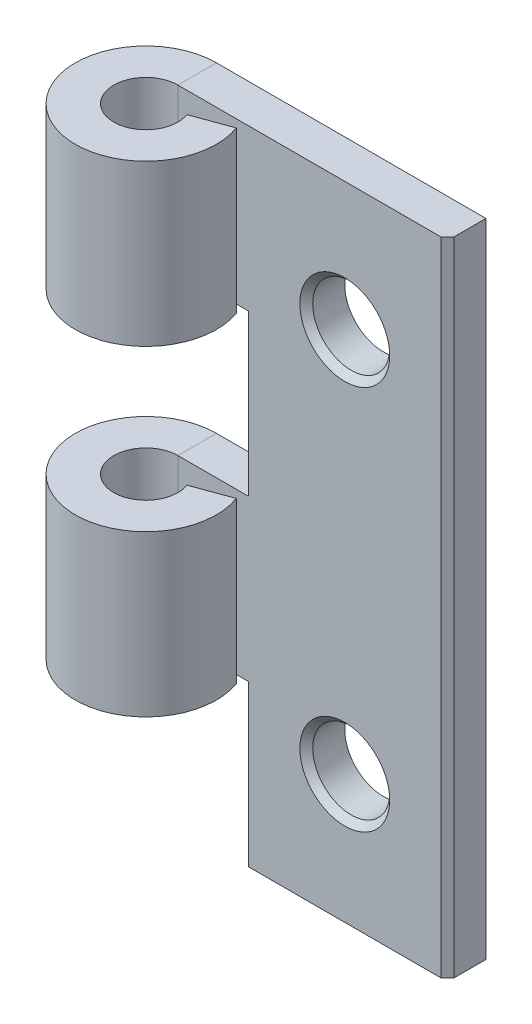
ISO-10303-21;
HEADER;
FILE_DESCRIPTION(('STEP AP214'),'2;1');
FILE_NAME('part.step','',(''),(''),'','','');
FILE_SCHEMA(('AUTOMOTIVE_DESIGN { 1 0 10303 214 1 1 1 1 }'));
ENDSEC;
DATA;
#1=APPLICATION_CONTEXT('core data for automotive mechanical design processes');
#2=APPLICATION_PROTOCOL_DEFINITION('international standard','automotive_design',2000,#1);
#3=PRODUCT_CONTEXT('',#1,'mechanical');
#4=PRODUCT('Part','Part','',(#3));
#5=PRODUCT_RELATED_PRODUCT_CATEGORY('part','',(#4));
#6=PRODUCT_DEFINITION_FORMATION('','',#4);
#7=PRODUCT_DEFINITION_CONTEXT('part definition',#1,'design');
#8=PRODUCT_DEFINITION('design','',#6,#7);
#9=PRODUCT_DEFINITION_SHAPE('','',#8);
#10=(LENGTH_UNIT() NAMED_UNIT(*) SI_UNIT(.MILLI.,.METRE.));
#11=(NAMED_UNIT(*) PLANE_ANGLE_UNIT() SI_UNIT($,.RADIAN.));
#12=(NAMED_UNIT(*) SI_UNIT($,.STERADIAN.) SOLID_ANGLE_UNIT());
#13=UNCERTAINTY_MEASURE_WITH_UNIT(LENGTH_MEASURE(1.E-05),#10,'distance_accuracy_value','');
#14=(GEOMETRIC_REPRESENTATION_CONTEXT(3) GLOBAL_UNCERTAINTY_ASSIGNED_CONTEXT((#13)) GLOBAL_UNIT_ASSIGNED_CONTEXT((#10,
#11,#12)) REPRESENTATION_CONTEXT('',''));
#15=CARTESIAN_POINT('',(0.,0.,0.));
#16=DIRECTION('',(0.,0.,1.));
#17=DIRECTION('',(1.,0.,0.));
#18=AXIS2_PLACEMENT_3D('',#15,#16,#17);
#19=CARTESIAN_POINT('',(10.5,-25.,3.));
#20=DIRECTION('',(-1.,0.,0.));
#21=DIRECTION('',(0.,0.,1.));
#22=AXIS2_PLACEMENT_3D('',#19,#20,#21);
#23=PLANE('',#22);
#24=DIRECTION('',(0.,0.,-1.));
#25=VECTOR('',#24,1.);
#26=CARTESIAN_POINT('',(10.5,25.,3.));
#27=LINE('',#26,#25);
#28=CARTESIAN_POINT('',(10.5,25.,2.49999999999999));
#29=VERTEX_POINT('',#28);
#30=CARTESIAN_POINT('',(10.5,25.,0.));
#31=VERTEX_POINT('',#30);
#32=EDGE_CURVE('E276',#29,#31,#27,.T.);
#33=ORIENTED_EDGE('',*,*,#32,.F.);
#34=DIRECTION('',(0.,-1.,0.));
#35=VECTOR('',#34,1.);
#36=CARTESIAN_POINT('',(10.5,-25.,2.49999999999999));
#37=LINE('',#36,#35);
#38=CARTESIAN_POINT('',(10.5,-25.,2.49999999999999));
#39=VERTEX_POINT('',#38);
#40=EDGE_CURVE('E54',#29,#39,#37,.T.);
#41=ORIENTED_EDGE('',*,*,#40,.T.);
#42=DIRECTION('',(0.,0.,-1.));
#43=VECTOR('',#42,1.);
#44=CARTESIAN_POINT('',(10.5,-25.,3.));
#45=LINE('',#44,#43);
#46=CARTESIAN_POINT('',(10.5,-25.,0.));
#47=VERTEX_POINT('',#46);
#48=EDGE_CURVE('E262',#39,#47,#45,.T.);
#49=ORIENTED_EDGE('',*,*,#48,.T.);
#50=DIRECTION('',(0.,1.,0.));
#51=VECTOR('',#50,1.);
#52=CARTESIAN_POINT('',(10.5,-25.,0.));
#53=LINE('',#52,#51);
#54=EDGE_CURVE('E251',#47,#31,#53,.T.);
#55=ORIENTED_EDGE('',*,*,#54,.T.);
#56=EDGE_LOOP('',(#33,#41,#49,#55));
#57=FACE_BOUND('',#56,.T.);
#58=ADVANCED_FACE('F38',(#57),#23,.F.);
#59=CARTESIAN_POINT('',(-10.5,25.,3.));
#60=DIRECTION('',(0.,-1.,0.));
#61=DIRECTION('',(0.,0.,-1.));
#62=AXIS2_PLACEMENT_3D('',#59,#60,#61);
#63=PLANE('',#62);
#64=DIRECTION('',(-1.,0.,0.));
#65=VECTOR('',#64,1.);
#66=CARTESIAN_POINT('',(-10.5,25.,3.));
#67=LINE('',#66,#65);
#68=CARTESIAN_POINT('',(9.99999999999998,25.,3.));
#69=VERTEX_POINT('',#68);
#70=CARTESIAN_POINT('',(-10.5,25.,3.));
#71=VERTEX_POINT('',#70);
#72=EDGE_CURVE('E253',#69,#71,#67,.T.);
#73=ORIENTED_EDGE('',*,*,#72,.F.);
#74=DIRECTION('',(-0.707106781186548,0.,0.707106781186548));
#75=VECTOR('',#74,1.);
#76=CARTESIAN_POINT('',(9.99999999999999,25.,3.));
#77=LINE('',#76,#75);
#78=EDGE_CURVE('E62',#69,#29,#77,.F.);
#79=ORIENTED_EDGE('',*,*,#78,.T.);
#80=ORIENTED_EDGE('',*,*,#32,.T.);
#81=DIRECTION('',(-1.,0.,0.));
#82=VECTOR('',#81,1.);
#83=CARTESIAN_POINT('',(-10.5,25.,0.));
#84=LINE('',#83,#82);
#85=CARTESIAN_POINT('',(-10.5,25.,0.));
#86=VERTEX_POINT('',#85);
#87=EDGE_CURVE('E265',#31,#86,#84,.T.);
#88=ORIENTED_EDGE('',*,*,#87,.T.);
#89=DIRECTION('',(0.,0.,-1.));
#90=VECTOR('',#89,1.);
#91=CARTESIAN_POINT('',(-10.5,25.,3.));
#92=LINE('',#91,#90);
#93=EDGE_CURVE('E274',#71,#86,#92,.T.);
#94=ORIENTED_EDGE('',*,*,#93,.F.);
#95=EDGE_LOOP('',(#73,#79,#80,#88,#94));
#96=FACE_BOUND('',#95,.T.);
#97=ADVANCED_FACE('F311',(#96),#63,.F.);
#98=CARTESIAN_POINT('',(-10.5,-25.,3.));
#99=DIRECTION('',(0.,1.,0.));
#100=DIRECTION('',(0.,0.,1.));
#101=AXIS2_PLACEMENT_3D('',#98,#99,#100);
#102=PLANE('',#101);
#103=ORIENTED_EDGE('',*,*,#48,.F.);
#104=DIRECTION('',(0.707106781186548,0.,-0.707106781186548));
#105=VECTOR('',#104,1.);
#106=CARTESIAN_POINT('',(9.99999999999999,-25.,3.));
#107=LINE('',#106,#105);
#108=CARTESIAN_POINT('',(9.99999999999998,-25.,3.));
#109=VERTEX_POINT('',#108);
#110=EDGE_CURVE('E289',#39,#109,#107,.F.);
#111=ORIENTED_EDGE('',*,*,#110,.T.);
#112=DIRECTION('',(1.,0.,0.));
#113=VECTOR('',#112,1.);
#114=CARTESIAN_POINT('',(-10.5,-25.,3.));
#115=LINE('',#114,#113);
#116=CARTESIAN_POINT('',(-5.,-25.,3.));
#117=VERTEX_POINT('',#116);
#118=EDGE_CURVE('E259',#117,#109,#115,.T.);
#119=ORIENTED_EDGE('',*,*,#118,.F.);
#120=DIRECTION('',(0.,0.,1.));
#121=VECTOR('',#120,1.);
#122=CARTESIAN_POINT('',(-5.,-25.,0.));
#123=LINE('',#122,#121);
#124=CARTESIAN_POINT('',(-5.,-25.,0.));
#125=VERTEX_POINT('',#124);
#126=EDGE_CURVE('E181',#125,#117,#123,.T.);
#127=ORIENTED_EDGE('',*,*,#126,.F.);
#128=DIRECTION('',(1.,0.,0.));
#129=VECTOR('',#128,1.);
#130=CARTESIAN_POINT('',(-10.5,-25.,0.));
#131=LINE('',#130,#129);
#132=EDGE_CURVE('E256',#125,#47,#131,.T.);
#133=ORIENTED_EDGE('',*,*,#132,.T.);
#134=EDGE_LOOP('',(#103,#111,#119,#127,#133));
#135=FACE_BOUND('',#134,.T.);
#136=ADVANCED_FACE('F316',(#135),#102,.F.);
#137=CARTESIAN_POINT('',(0.,0.,3.));
#138=DIRECTION('',(0.,0.,-1.));
#139=DIRECTION('',(-1.,0.,0.));
#140=AXIS2_PLACEMENT_3D('',#137,#138,#139);
#141=PLANE('',#140);
#142=CARTESIAN_POINT('',(2.5,-15.,3.));
#143=DIRECTION('',(0.,0.,-1.));
#144=DIRECTION('',(-1.,0.,0.));
#145=AXIS2_PLACEMENT_3D('',#142,#143,#144);
#146=CIRCLE('',#145,3.50000000000001);
#147=CARTESIAN_POINT('',(-1.00000000000001,-15.,3.));
#148=VERTEX_POINT('',#147);
#149=EDGE_CURVE('E281',#148,#148,#146,.T.);
#150=ORIENTED_EDGE('',*,*,#149,.T.);
#151=EDGE_LOOP('',(#150));
#152=FACE_BOUND('',#151,.T.);
#153=CARTESIAN_POINT('',(2.5,15.,3.));
#154=DIRECTION('',(0.,0.,-1.));
#155=DIRECTION('',(-1.,0.,0.));
#156=AXIS2_PLACEMENT_3D('',#153,#154,#155);
#157=CIRCLE('',#156,3.50000000000001);
#158=CARTESIAN_POINT('',(-1.00000000000001,15.,3.));
#159=VERTEX_POINT('',#158);
#160=EDGE_CURVE('E278',#159,#159,#157,.T.);
#161=ORIENTED_EDGE('',*,*,#160,.T.);
#162=EDGE_LOOP('',(#161));
#163=FACE_BOUND('',#162,.T.);
#164=ORIENTED_EDGE('',*,*,#118,.T.);
#165=DIRECTION('',(0.,1.,0.));
#166=VECTOR('',#165,1.);
#167=CARTESIAN_POINT('',(9.99999999999999,0.,3.));
#168=LINE('',#167,#166);
#169=EDGE_CURVE('E284',#109,#69,#168,.T.);
#170=ORIENTED_EDGE('',*,*,#169,.T.);
#171=ORIENTED_EDGE('',*,*,#72,.T.);
#172=DIRECTION('',(0.,-1.,0.));
#173=VECTOR('',#172,1.);
#174=CARTESIAN_POINT('',(-10.5,-25.,3.));
#175=LINE('',#174,#173);
#176=CARTESIAN_POINT('',(-10.5,12.5,3.));
#177=VERTEX_POINT('',#176);
#178=EDGE_CURVE('E255',#71,#177,#175,.T.);
#179=ORIENTED_EDGE('',*,*,#178,.T.);
#180=DIRECTION('',(-1.,0.,0.));
#181=VECTOR('',#180,1.);
#182=CARTESIAN_POINT('',(-5.,12.5,3.));
#183=LINE('',#182,#181);
#184=CARTESIAN_POINT('',(-5.,12.5,3.));
#185=VERTEX_POINT('',#184);
#186=EDGE_CURVE('E173',#185,#177,#183,.T.);
#187=ORIENTED_EDGE('',*,*,#186,.F.);
#188=DIRECTION('',(0.,1.,0.));
#189=VECTOR('',#188,1.);
#190=CARTESIAN_POINT('',(-5.,12.5,3.));
#191=LINE('',#190,#189);
#192=CARTESIAN_POINT('',(-5.,0.,3.));
#193=VERTEX_POINT('',#192);
#194=EDGE_CURVE('E153',#193,#185,#191,.T.);
#195=ORIENTED_EDGE('',*,*,#194,.F.);
#196=DIRECTION('',(1.,0.,0.));
#197=VECTOR('',#196,1.);
#198=CARTESIAN_POINT('',(-5.,0.,3.));
#199=LINE('',#198,#197);
#200=CARTESIAN_POINT('',(-10.5,0.,3.));
#201=VERTEX_POINT('',#200);
#202=EDGE_CURVE('E170',#201,#193,#199,.T.);
#203=ORIENTED_EDGE('',*,*,#202,.F.);
#204=DIRECTION('',(0.,-1.,0.));
#205=VECTOR('',#204,1.);
#206=CARTESIAN_POINT('',(-10.5,-12.5,3.));
#207=LINE('',#206,#205);
#208=CARTESIAN_POINT('',(-10.5,-12.5,3.));
#209=VERTEX_POINT('',#208);
#210=EDGE_CURVE('E214',#209,#201,#207,.F.);
#211=ORIENTED_EDGE('',*,*,#210,.F.);
#212=DIRECTION('',(-1.,0.,0.));
#213=VECTOR('',#212,1.);
#214=CARTESIAN_POINT('',(-5.,-12.5,3.));
#215=LINE('',#214,#213);
#216=CARTESIAN_POINT('',(-5.,-12.5,3.));
#217=VERTEX_POINT('',#216);
#218=EDGE_CURVE('E189',#217,#209,#215,.T.);
#219=ORIENTED_EDGE('',*,*,#218,.F.);
#220=DIRECTION('',(0.,1.,0.));
#221=VECTOR('',#220,1.);
#222=CARTESIAN_POINT('',(-5.,-12.5,3.));
#223=LINE('',#222,#221);
#224=EDGE_CURVE('E193',#117,#217,#223,.T.);
#225=ORIENTED_EDGE('',*,*,#224,.F.);
#226=EDGE_LOOP('',(#164,#170,#171,#179,#187,#195,#203,#211,#219,#225));
#227=FACE_BOUND('',#226,.T.);
#228=ADVANCED_FACE('F328',(#152,#163,#227),#141,.F.);
#229=CARTESIAN_POINT('',(0.,0.,0.));
#230=DIRECTION('',(0.,0.,-1.));
#231=DIRECTION('',(-1.,0.,0.));
#232=AXIS2_PLACEMENT_3D('',#229,#230,#231);
#233=PLANE('',#232);
#234=CARTESIAN_POINT('',(2.5,15.,0.));
#235=DIRECTION('',(0.,0.,-1.));
#236=DIRECTION('',(-1.,0.,0.));
#237=AXIS2_PLACEMENT_3D('',#234,#235,#236);
#238=CIRCLE('',#237,3.);
#239=CARTESIAN_POINT('',(-0.500000000000002,15.,0.));
#240=VERTEX_POINT('',#239);
#241=EDGE_CURVE('E402',#240,#240,#238,.T.);
#242=ORIENTED_EDGE('',*,*,#241,.F.);
#243=EDGE_LOOP('',(#242));
#244=FACE_BOUND('',#243,.T.);
#245=CARTESIAN_POINT('',(2.5,-15.,0.));
#246=DIRECTION('',(0.,0.,-1.));
#247=DIRECTION('',(-1.,0.,0.));
#248=AXIS2_PLACEMENT_3D('',#245,#246,#247);
#249=CIRCLE('',#248,3.);
#250=CARTESIAN_POINT('',(-0.5,-15.,0.));
#251=VERTEX_POINT('',#250);
#252=EDGE_CURVE('E176',#251,#251,#249,.T.);
#253=ORIENTED_EDGE('',*,*,#252,.F.);
#254=EDGE_LOOP('',(#253));
#255=FACE_BOUND('',#254,.T.);
#256=DIRECTION('',(1.,0.,0.));
#257=VECTOR('',#256,1.);
#258=CARTESIAN_POINT('',(-5.,0.,0.));
#259=LINE('',#258,#257);
#260=CARTESIAN_POINT('',(-10.5,0.,0.));
#261=VERTEX_POINT('',#260);
#262=CARTESIAN_POINT('',(-5.,0.,0.));
#263=VERTEX_POINT('',#262);
#264=EDGE_CURVE('E157',#261,#263,#259,.T.);
#265=ORIENTED_EDGE('',*,*,#264,.T.);
#266=DIRECTION('',(0.,1.,0.));
#267=VECTOR('',#266,1.);
#268=CARTESIAN_POINT('',(-5.,12.5,0.));
#269=LINE('',#268,#267);
#270=CARTESIAN_POINT('',(-5.,12.5,0.));
#271=VERTEX_POINT('',#270);
#272=EDGE_CURVE('E150',#263,#271,#269,.T.);
#273=ORIENTED_EDGE('',*,*,#272,.T.);
#274=DIRECTION('',(-1.,0.,0.));
#275=VECTOR('',#274,1.);
#276=CARTESIAN_POINT('',(-5.,12.5,0.));
#277=LINE('',#276,#275);
#278=CARTESIAN_POINT('',(-10.5,12.5,0.));
#279=VERTEX_POINT('',#278);
#280=EDGE_CURVE('E160',#271,#279,#277,.T.);
#281=ORIENTED_EDGE('',*,*,#280,.T.);
#282=DIRECTION('',(0.,-1.,0.));
#283=VECTOR('',#282,1.);
#284=CARTESIAN_POINT('',(-10.5,-25.,0.));
#285=LINE('',#284,#283);
#286=EDGE_CURVE('E268',#86,#279,#285,.T.);
#287=ORIENTED_EDGE('',*,*,#286,.F.);
#288=ORIENTED_EDGE('',*,*,#87,.F.);
#289=ORIENTED_EDGE('',*,*,#54,.F.);
#290=ORIENTED_EDGE('',*,*,#132,.F.);
#291=DIRECTION('',(0.,1.,0.));
#292=VECTOR('',#291,1.);
#293=CARTESIAN_POINT('',(-5.,-12.5,0.));
#294=LINE('',#293,#292);
#295=CARTESIAN_POINT('',(-5.,-12.5,0.));
#296=VERTEX_POINT('',#295);
#297=EDGE_CURVE('E185',#125,#296,#294,.T.);
#298=ORIENTED_EDGE('',*,*,#297,.T.);
#299=DIRECTION('',(-1.,0.,0.));
#300=VECTOR('',#299,1.);
#301=CARTESIAN_POINT('',(-5.,-12.5,0.));
#302=LINE('',#301,#300);
#303=CARTESIAN_POINT('',(-10.5,-12.5,0.));
#304=VERTEX_POINT('',#303);
#305=EDGE_CURVE('E188',#296,#304,#302,.T.);
#306=ORIENTED_EDGE('',*,*,#305,.T.);
#307=DIRECTION('',(0.,-1.,0.));
#308=VECTOR('',#307,1.);
#309=CARTESIAN_POINT('',(-10.5,-12.5,0.));
#310=LINE('',#309,#308);
#311=EDGE_CURVE('E199',#304,#261,#310,.F.);
#312=ORIENTED_EDGE('',*,*,#311,.T.);
#313=EDGE_LOOP('',(#265,#273,#281,#287,#288,#289,#290,#298,#306,#312));
#314=FACE_BOUND('',#313,.T.);
#315=ADVANCED_FACE('F168',(#244,#255,#314),#233,.T.);
#316=CARTESIAN_POINT('',(-8.15076844803524,18.75,4.6449496416858));
#317=DIRECTION('',(0.342020143325679,0.,0.939692620785905));
#318=DIRECTION('',(0.,-1.,0.));
#319=AXIS2_PLACEMENT_3D('',#316,#317,#318);
#320=PLANE('',#319);
#321=DIRECTION('',(0.939692620785905,0.,-0.342020143325679));
#322=VECTOR('',#321,1.);
#323=CARTESIAN_POINT('',(-8.15076844803524,12.5,4.6449496416858));
#324=LINE('',#323,#322);
#325=CARTESIAN_POINT('',(-8.15076844803524,12.5,4.6449496416858));
#326=VERTEX_POINT('',#325);
#327=CARTESIAN_POINT('',(-5.33169058567753,12.5,3.61888921170877));
#328=VERTEX_POINT('',#327);
#329=EDGE_CURVE('E249',#326,#328,#324,.T.);
#330=ORIENTED_EDGE('',*,*,#329,.F.);
#331=DIRECTION('',(0.,-1.,0.));
#332=VECTOR('',#331,1.);
#333=CARTESIAN_POINT('',(-8.15076844803524,12.5,4.6449496416858));
#334=LINE('',#333,#332);
#335=CARTESIAN_POINT('',(-8.15076844803524,25.,4.6449496416858));
#336=VERTEX_POINT('',#335);
#337=EDGE_CURVE('E229',#336,#326,#334,.T.);
#338=ORIENTED_EDGE('',*,*,#337,.F.);
#339=DIRECTION('',(0.939692620785905,0.,-0.342020143325679));
#340=VECTOR('',#339,1.);
#341=CARTESIAN_POINT('',(-8.15076844803524,25.,4.6449496416858));
#342=LINE('',#341,#340);
#343=CARTESIAN_POINT('',(-5.33169058567753,25.,3.61888921170877));
#344=VERTEX_POINT('',#343);
#345=EDGE_CURVE('E247',#336,#344,#342,.T.);
#346=ORIENTED_EDGE('',*,*,#345,.T.);
#347=DIRECTION('',(0.,-1.,0.));
#348=VECTOR('',#347,1.);
#349=CARTESIAN_POINT('',(-5.33169058567753,12.5,3.61888921170877));
#350=LINE('',#349,#348);
#351=EDGE_CURVE('E235',#344,#328,#350,.T.);
#352=ORIENTED_EDGE('',*,*,#351,.T.);
#353=EDGE_LOOP('',(#330,#338,#346,#352));
#354=FACE_BOUND('',#353,.T.);
#355=ADVANCED_FACE('F332',(#354),#320,.F.);
#356=CARTESIAN_POINT('',(-10.5,25.,5.5));
#357=DIRECTION('',(0.,1.,0.));
#358=DIRECTION('',(0.,0.,1.));
#359=AXIS2_PLACEMENT_3D('',#356,#357,#358);
#360=PLANE('',#359);
#361=ORIENTED_EDGE('',*,*,#345,.F.);
#362=CARTESIAN_POINT('',(-10.5,25.,5.5));
#363=DIRECTION('',(0.,-1.,0.));
#364=DIRECTION('',(0.,0.,-1.));
#365=AXIS2_PLACEMENT_3D('',#362,#363,#364);
#366=CIRCLE('',#365,2.5);
#367=EDGE_CURVE('E238',#71,#336,#366,.F.);
#368=ORIENTED_EDGE('',*,*,#367,.F.);
#369=ORIENTED_EDGE('',*,*,#93,.T.);
#370=CARTESIAN_POINT('',(-10.5,25.,5.5));
#371=DIRECTION('',(0.,-1.,0.));
#372=DIRECTION('',(0.,0.,-1.));
#373=AXIS2_PLACEMENT_3D('',#370,#371,#372);
#374=CIRCLE('',#373,5.5);
#375=EDGE_CURVE('E231',#86,#344,#374,.F.);
#376=ORIENTED_EDGE('',*,*,#375,.T.);
#377=EDGE_LOOP('',(#361,#368,#369,#376));
#378=FACE_BOUND('',#377,.T.);
#379=ADVANCED_FACE('F341',(#378),#360,.T.);
#380=CARTESIAN_POINT('',(-10.5,12.5,5.5));
#381=DIRECTION('',(0.,1.,0.));
#382=DIRECTION('',(0.,0.,1.));
#383=AXIS2_PLACEMENT_3D('',#380,#381,#382);
#384=PLANE('',#383);
#385=CARTESIAN_POINT('',(-10.5,12.5,5.5));
#386=DIRECTION('',(0.,-1.,0.));
#387=DIRECTION('',(0.,0.,-1.));
#388=AXIS2_PLACEMENT_3D('',#385,#386,#387);
#389=CIRCLE('',#388,2.5);
#390=EDGE_CURVE('E242',#326,#177,#389,.T.);
#391=ORIENTED_EDGE('',*,*,#390,.F.);
#392=ORIENTED_EDGE('',*,*,#329,.T.);
#393=CARTESIAN_POINT('',(-10.5,12.5,5.5));
#394=DIRECTION('',(0.,-1.,0.));
#395=DIRECTION('',(0.,0.,-1.));
#396=AXIS2_PLACEMENT_3D('',#393,#394,#395);
#397=CIRCLE('',#396,5.5);
#398=EDGE_CURVE('E234',#328,#279,#397,.T.);
#399=ORIENTED_EDGE('',*,*,#398,.T.);
#400=DIRECTION('',(0.,0.,-1.));
#401=VECTOR('',#400,1.);
#402=CARTESIAN_POINT('',(-10.5,12.5,3.));
#403=LINE('',#402,#401);
#404=EDGE_CURVE('E163',#177,#279,#403,.T.);
#405=ORIENTED_EDGE('',*,*,#404,.F.);
#406=EDGE_LOOP('',(#391,#392,#399,#405));
#407=FACE_BOUND('',#406,.T.);
#408=ADVANCED_FACE('F337',(#407),#384,.F.);
#409=CARTESIAN_POINT('',(-10.5,12.5,5.5));
#410=DIRECTION('',(0.,-1.,0.));
#411=DIRECTION('',(0.939692620785905,0.,-0.342020143325679));
#412=AXIS2_PLACEMENT_3D('',#409,#410,#411);
#413=CYLINDRICAL_SURFACE('',#412,5.5);
#414=ORIENTED_EDGE('',*,*,#286,.T.);
#415=ORIENTED_EDGE('',*,*,#398,.F.);
#416=ORIENTED_EDGE('',*,*,#351,.F.);
#417=ORIENTED_EDGE('',*,*,#375,.F.);
#418=EDGE_LOOP('',(#414,#415,#416,#417));
#419=FACE_BOUND('',#418,.T.);
#420=ADVANCED_FACE('F340',(#419),#413,.T.);
#421=CARTESIAN_POINT('',(-10.5,12.5,5.5));
#422=DIRECTION('',(0.,-1.,0.));
#423=DIRECTION('',(0.939692620785905,0.,-0.342020143325679));
#424=AXIS2_PLACEMENT_3D('',#421,#422,#423);
#425=CYLINDRICAL_SURFACE('',#424,2.5);
#426=ORIENTED_EDGE('',*,*,#178,.F.);
#427=ORIENTED_EDGE('',*,*,#367,.T.);
#428=ORIENTED_EDGE('',*,*,#337,.T.);
#429=ORIENTED_EDGE('',*,*,#390,.T.);
#430=EDGE_LOOP('',(#426,#427,#428,#429));
#431=FACE_BOUND('',#430,.T.);
#432=ADVANCED_FACE('F349',(#431),#425,.F.);
#433=CARTESIAN_POINT('',(-8.15076844803524,-6.25,4.6449496416858));
#434=DIRECTION('',(0.342020143325679,0.,0.939692620785905));
#435=DIRECTION('',(0.,-1.,0.));
#436=AXIS2_PLACEMENT_3D('',#433,#434,#435);
#437=PLANE('',#436);
#438=DIRECTION('',(0.939692620785905,0.,-0.342020143325679));
#439=VECTOR('',#438,1.);
#440=CARTESIAN_POINT('',(-8.15076844803524,-12.5,4.6449496416858));
#441=LINE('',#440,#439);
#442=CARTESIAN_POINT('',(-8.15076844803524,-12.5,4.6449496416858));
#443=VERTEX_POINT('',#442);
#444=CARTESIAN_POINT('',(-5.33169058567752,-12.5,3.61888921170877));
#445=VERTEX_POINT('',#444);
#446=EDGE_CURVE('E227',#443,#445,#441,.T.);
#447=ORIENTED_EDGE('',*,*,#446,.F.);
#448=DIRECTION('',(0.,-1.,0.));
#449=VECTOR('',#448,1.);
#450=CARTESIAN_POINT('',(-8.15076844803524,-12.5,4.6449496416858));
#451=LINE('',#450,#449);
#452=CARTESIAN_POINT('',(-8.15076844803524,0.,4.6449496416858));
#453=VERTEX_POINT('',#452);
#454=EDGE_CURVE('E183',#453,#443,#451,.T.);
#455=ORIENTED_EDGE('',*,*,#454,.F.);
#456=DIRECTION('',(0.939692620785905,0.,-0.342020143325679));
#457=VECTOR('',#456,1.);
#458=CARTESIAN_POINT('',(-8.15076844803524,0.,4.6449496416858));
#459=LINE('',#458,#457);
#460=CARTESIAN_POINT('',(-5.33169058567752,0.,3.61888921170877));
#461=VERTEX_POINT('',#460);
#462=EDGE_CURVE('E225',#453,#461,#459,.T.);
#463=ORIENTED_EDGE('',*,*,#462,.T.);
#464=DIRECTION('',(0.,-1.,0.));
#465=VECTOR('',#464,1.);
#466=CARTESIAN_POINT('',(-5.33169058567752,-12.5,3.61888921170877));
#467=LINE('',#466,#465);
#468=EDGE_CURVE('E206',#461,#445,#467,.T.);
#469=ORIENTED_EDGE('',*,*,#468,.T.);
#470=EDGE_LOOP('',(#447,#455,#463,#469));
#471=FACE_BOUND('',#470,.T.);
#472=ADVANCED_FACE('F352',(#471),#437,.F.);
#473=CARTESIAN_POINT('',(-10.5,0.,5.5));
#474=DIRECTION('',(0.,1.,0.));
#475=DIRECTION('',(0.,0.,1.));
#476=AXIS2_PLACEMENT_3D('',#473,#474,#475);
#477=PLANE('',#476);
#478=ORIENTED_EDGE('',*,*,#462,.F.);
#479=CARTESIAN_POINT('',(-10.5,0.,5.5));
#480=DIRECTION('',(0.,-1.,0.));
#481=DIRECTION('',(0.,0.,-1.));
#482=AXIS2_PLACEMENT_3D('',#479,#480,#481);
#483=CIRCLE('',#482,2.5);
#484=EDGE_CURVE('E209',#201,#453,#483,.F.);
#485=ORIENTED_EDGE('',*,*,#484,.F.);
#486=DIRECTION('',(0.,0.,-1.));
#487=VECTOR('',#486,1.);
#488=CARTESIAN_POINT('',(-10.5,0.,3.));
#489=LINE('',#488,#487);
#490=EDGE_CURVE('E222',#201,#261,#489,.T.);
#491=ORIENTED_EDGE('',*,*,#490,.T.);
#492=CARTESIAN_POINT('',(-10.5,0.,5.5));
#493=DIRECTION('',(0.,-1.,0.));
#494=DIRECTION('',(0.,0.,-1.));
#495=AXIS2_PLACEMENT_3D('',#492,#493,#494);
#496=CIRCLE('',#495,5.5);
#497=EDGE_CURVE('E201',#261,#461,#496,.F.);
#498=ORIENTED_EDGE('',*,*,#497,.T.);
#499=EDGE_LOOP('',(#478,#485,#491,#498));
#500=FACE_BOUND('',#499,.T.);
#501=ADVANCED_FACE('F361',(#500),#477,.T.);
#502=CARTESIAN_POINT('',(-10.5,-12.5,5.5));
#503=DIRECTION('',(0.,1.,0.));
#504=DIRECTION('',(0.,0.,1.));
#505=AXIS2_PLACEMENT_3D('',#502,#503,#504);
#506=PLANE('',#505);
#507=CARTESIAN_POINT('',(-10.5,-12.5,5.5));
#508=DIRECTION('',(0.,-1.,0.));
#509=DIRECTION('',(0.,0.,-1.));
#510=AXIS2_PLACEMENT_3D('',#507,#508,#509);
#511=CIRCLE('',#510,2.5);
#512=EDGE_CURVE('E217',#443,#209,#511,.T.);
#513=ORIENTED_EDGE('',*,*,#512,.F.);
#514=ORIENTED_EDGE('',*,*,#446,.T.);
#515=CARTESIAN_POINT('',(-10.5,-12.5,5.5));
#516=DIRECTION('',(0.,-1.,0.));
#517=DIRECTION('',(0.,0.,-1.));
#518=AXIS2_PLACEMENT_3D('',#515,#516,#517);
#519=CIRCLE('',#518,5.5);
#520=EDGE_CURVE('E202',#445,#304,#519,.T.);
#521=ORIENTED_EDGE('',*,*,#520,.T.);
#522=DIRECTION('',(0.,0.,-1.));
#523=VECTOR('',#522,1.);
#524=CARTESIAN_POINT('',(-10.5,-12.5,3.));
#525=LINE('',#524,#523);
#526=EDGE_CURVE('E205',#209,#304,#525,.T.);
#527=ORIENTED_EDGE('',*,*,#526,.F.);
#528=EDGE_LOOP('',(#513,#514,#521,#527));
#529=FACE_BOUND('',#528,.T.);
#530=ADVANCED_FACE('F357',(#529),#506,.F.);
#531=CARTESIAN_POINT('',(-10.5,-12.5,5.5));
#532=DIRECTION('',(0.,-1.,0.));
#533=DIRECTION('',(0.939692620785905,0.,-0.342020143325679));
#534=AXIS2_PLACEMENT_3D('',#531,#532,#533);
#535=CYLINDRICAL_SURFACE('',#534,5.5);
#536=ORIENTED_EDGE('',*,*,#311,.F.);
#537=ORIENTED_EDGE('',*,*,#520,.F.);
#538=ORIENTED_EDGE('',*,*,#468,.F.);
#539=ORIENTED_EDGE('',*,*,#497,.F.);
#540=EDGE_LOOP('',(#536,#537,#538,#539));
#541=FACE_BOUND('',#540,.T.);
#542=ADVANCED_FACE('F360',(#541),#535,.T.);
#543=CARTESIAN_POINT('',(-10.5,-12.5,5.5));
#544=DIRECTION('',(0.,-1.,0.));
#545=DIRECTION('',(0.939692620785905,0.,-0.342020143325679));
#546=AXIS2_PLACEMENT_3D('',#543,#544,#545);
#547=CYLINDRICAL_SURFACE('',#546,2.5);
#548=ORIENTED_EDGE('',*,*,#210,.T.);
#549=ORIENTED_EDGE('',*,*,#484,.T.);
#550=ORIENTED_EDGE('',*,*,#454,.T.);
#551=ORIENTED_EDGE('',*,*,#512,.T.);
#552=EDGE_LOOP('',(#548,#549,#550,#551));
#553=FACE_BOUND('',#552,.T.);
#554=ADVANCED_FACE('F369',(#553),#547,.F.);
#555=CARTESIAN_POINT('',(-5.,-12.5,0.));
#556=DIRECTION('',(1.,0.,0.));
#557=DIRECTION('',(0.,0.,-1.));
#558=AXIS2_PLACEMENT_3D('',#555,#556,#557);
#559=PLANE('',#558);
#560=ORIENTED_EDGE('',*,*,#224,.T.);
#561=DIRECTION('',(0.,0.,1.));
#562=VECTOR('',#561,1.);
#563=CARTESIAN_POINT('',(-5.,-12.5,0.));
#564=LINE('',#563,#562);
#565=EDGE_CURVE('E192',#296,#217,#564,.T.);
#566=ORIENTED_EDGE('',*,*,#565,.F.);
#567=ORIENTED_EDGE('',*,*,#297,.F.);
#568=ORIENTED_EDGE('',*,*,#126,.T.);
#569=EDGE_LOOP('',(#560,#566,#567,#568));
#570=FACE_BOUND('',#569,.T.);
#571=ADVANCED_FACE('F372',(#570),#559,.F.);
#572=CARTESIAN_POINT('',(-5.,-12.5,0.));
#573=DIRECTION('',(0.,1.,0.));
#574=DIRECTION('',(0.,0.,1.));
#575=AXIS2_PLACEMENT_3D('',#572,#573,#574);
#576=PLANE('',#575);
#577=ORIENTED_EDGE('',*,*,#218,.T.);
#578=ORIENTED_EDGE('',*,*,#526,.T.);
#579=ORIENTED_EDGE('',*,*,#305,.F.);
#580=ORIENTED_EDGE('',*,*,#565,.T.);
#581=EDGE_LOOP('',(#577,#578,#579,#580));
#582=FACE_BOUND('',#581,.T.);
#583=ADVANCED_FACE('F379',(#582),#576,.F.);
#584=CARTESIAN_POINT('',(-5.,12.5,0.));
#585=DIRECTION('',(1.,0.,0.));
#586=DIRECTION('',(0.,0.,-1.));
#587=AXIS2_PLACEMENT_3D('',#584,#585,#586);
#588=PLANE('',#587);
#589=ORIENTED_EDGE('',*,*,#194,.T.);
#590=DIRECTION('',(0.,0.,1.));
#591=VECTOR('',#590,1.);
#592=CARTESIAN_POINT('',(-5.,12.5,0.));
#593=LINE('',#592,#591);
#594=EDGE_CURVE('E146',#271,#185,#593,.T.);
#595=ORIENTED_EDGE('',*,*,#594,.F.);
#596=ORIENTED_EDGE('',*,*,#272,.F.);
#597=DIRECTION('',(0.,0.,1.));
#598=VECTOR('',#597,1.);
#599=CARTESIAN_POINT('',(-5.,0.,0.));
#600=LINE('',#599,#598);
#601=EDGE_CURVE('E156',#263,#193,#600,.T.);
#602=ORIENTED_EDGE('',*,*,#601,.T.);
#603=EDGE_LOOP('',(#589,#595,#596,#602));
#604=FACE_BOUND('',#603,.T.);
#605=ADVANCED_FACE('F148',(#604),#588,.F.);
#606=CARTESIAN_POINT('',(-5.,0.,0.));
#607=DIRECTION('',(0.,-1.,0.));
#608=DIRECTION('',(0.,0.,-1.));
#609=AXIS2_PLACEMENT_3D('',#606,#607,#608);
#610=PLANE('',#609);
#611=ORIENTED_EDGE('',*,*,#202,.T.);
#612=ORIENTED_EDGE('',*,*,#601,.F.);
#613=ORIENTED_EDGE('',*,*,#264,.F.);
#614=ORIENTED_EDGE('',*,*,#490,.F.);
#615=EDGE_LOOP('',(#611,#612,#613,#614));
#616=FACE_BOUND('',#615,.T.);
#617=ADVANCED_FACE('F386',(#616),#610,.F.);
#618=CARTESIAN_POINT('',(-5.,12.5,0.));
#619=DIRECTION('',(0.,1.,0.));
#620=DIRECTION('',(0.,0.,1.));
#621=AXIS2_PLACEMENT_3D('',#618,#619,#620);
#622=PLANE('',#621);
#623=ORIENTED_EDGE('',*,*,#186,.T.);
#624=ORIENTED_EDGE('',*,*,#404,.T.);
#625=ORIENTED_EDGE('',*,*,#280,.F.);
#626=ORIENTED_EDGE('',*,*,#594,.T.);
#627=EDGE_LOOP('',(#623,#624,#625,#626));
#628=FACE_BOUND('',#627,.T.);
#629=ADVANCED_FACE('F161',(#628),#622,.F.);
#630=CARTESIAN_POINT('',(2.5,-15.,3.));
#631=DIRECTION('',(0.,0.,1.));
#632=DIRECTION('',(1.,0.,0.));
#633=AXIS2_PLACEMENT_3D('',#630,#631,#632);
#634=CYLINDRICAL_SURFACE('',#633,3.);
#635=CARTESIAN_POINT('',(2.5,-15.,2.49999999999999));
#636=DIRECTION('',(0.,0.,-1.));
#637=DIRECTION('',(-1.,0.,0.));
#638=AXIS2_PLACEMENT_3D('',#635,#636,#637);
#639=CIRCLE('',#638,3.);
#640=CARTESIAN_POINT('',(-0.5,-15.,2.49999999999999));
#641=VERTEX_POINT('',#640);
#642=EDGE_CURVE('E47',#641,#641,#639,.F.);
#643=ORIENTED_EDGE('',*,*,#642,.T.);
#644=EDGE_LOOP('',(#643));
#645=FACE_BOUND('',#644,.T.);
#646=ORIENTED_EDGE('',*,*,#252,.T.);
#647=EDGE_LOOP('',(#646));
#648=FACE_BOUND('',#647,.T.);
#649=ADVANCED_FACE('F293',(#645,#648),#634,.F.);
#650=CARTESIAN_POINT('',(2.5,15.,3.));
#651=DIRECTION('',(0.,0.,1.));
#652=DIRECTION('',(1.,0.,0.));
#653=AXIS2_PLACEMENT_3D('',#650,#651,#652);
#654=CYLINDRICAL_SURFACE('',#653,3.);
#655=CARTESIAN_POINT('',(2.5,15.,2.49999999999999));
#656=DIRECTION('',(0.,0.,-1.));
#657=DIRECTION('',(-1.,0.,0.));
#658=AXIS2_PLACEMENT_3D('',#655,#656,#657);
#659=CIRCLE('',#658,3.);
#660=CARTESIAN_POINT('',(-0.500000000000002,15.,2.49999999999999));
#661=VERTEX_POINT('',#660);
#662=EDGE_CURVE('E11',#661,#661,#659,.F.);
#663=ORIENTED_EDGE('',*,*,#662,.T.);
#664=EDGE_LOOP('',(#663));
#665=FACE_BOUND('',#664,.T.);
#666=ORIENTED_EDGE('',*,*,#241,.T.);
#667=EDGE_LOOP('',(#666));
#668=FACE_BOUND('',#667,.T.);
#669=ADVANCED_FACE('F305',(#665,#668),#654,.F.);
#670=CARTESIAN_POINT('',(9.99999999999999,0.,3.));
#671=DIRECTION('',(-0.707106781186548,0.,-0.707106781186548));
#672=DIRECTION('',(0.,1.,0.));
#673=AXIS2_PLACEMENT_3D('',#670,#671,#672);
#674=PLANE('',#673);
#675=ORIENTED_EDGE('',*,*,#110,.F.);
#676=ORIENTED_EDGE('',*,*,#40,.F.);
#677=ORIENTED_EDGE('',*,*,#78,.F.);
#678=ORIENTED_EDGE('',*,*,#169,.F.);
#679=EDGE_LOOP('',(#675,#676,#677,#678));
#680=FACE_BOUND('',#679,.T.);
#681=ADVANCED_FACE('F298',(#680),#674,.F.);
#682=CARTESIAN_POINT('',(2.5,-15.,2.49999999999999));
#683=DIRECTION('',(0.,0.,1.));
#684=DIRECTION('',(1.,0.,0.));
#685=AXIS2_PLACEMENT_3D('',#682,#683,#684);
#686=CONICAL_SURFACE('',#685,3.,0.785398163397452);
#687=ORIENTED_EDGE('',*,*,#149,.F.);
#688=EDGE_LOOP('',(#687));
#689=FACE_BOUND('',#688,.T.);
#690=ORIENTED_EDGE('',*,*,#642,.F.);
#691=EDGE_LOOP('',(#690));
#692=FACE_BOUND('',#691,.T.);
#693=ADVANCED_FACE('F296',(#689,#692),#686,.F.);
#694=CARTESIAN_POINT('',(2.5,15.,2.49999999999999));
#695=DIRECTION('',(0.,0.,1.));
#696=DIRECTION('',(1.,0.,0.));
#697=AXIS2_PLACEMENT_3D('',#694,#695,#696);
#698=CONICAL_SURFACE('',#697,3.,0.785398163397452);
#699=ORIENTED_EDGE('',*,*,#160,.F.);
#700=EDGE_LOOP('',(#699));
#701=FACE_BOUND('',#700,.T.);
#702=ORIENTED_EDGE('',*,*,#662,.F.);
#703=EDGE_LOOP('',(#702));
#704=FACE_BOUND('',#703,.T.);
#705=ADVANCED_FACE('F41',(#701,#704),#698,.F.);
#706=CLOSED_SHELL('',(#58,#97,#136,#228,#315,#355,#379,#408,#420,#432,#472,#501,#530,#542,#554,
#571,#583,#605,#617,#629,#649,#669,#681,#693,#705));
#707=MANIFOLD_SOLID_BREP('B2',#706);
#708=ADVANCED_BREP_SHAPE_REPRESENTATION('',(#18,#707),#14);
#709=SHAPE_DEFINITION_REPRESENTATION(#9,#708);
ENDSEC;
END-ISO-10303-21;
